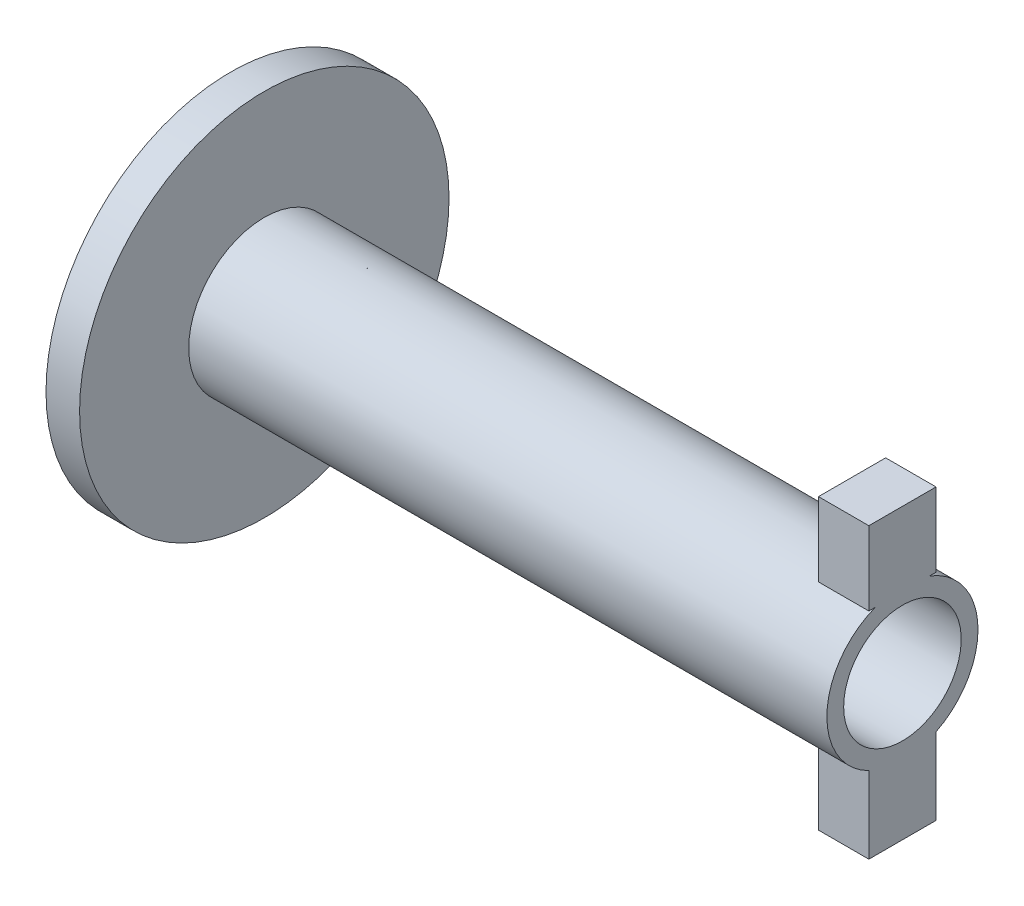
ISO-10303-21;
HEADER;
FILE_DESCRIPTION(('STEP AP214'),'2;1');
FILE_NAME('part.step','',(''),(''),'','','');
FILE_SCHEMA(('AUTOMOTIVE_DESIGN { 1 0 10303 214 1 1 1 1 }'));
ENDSEC;
DATA;
#1=APPLICATION_CONTEXT('core data for automotive mechanical design processes');
#2=APPLICATION_PROTOCOL_DEFINITION('international standard','automotive_design',2000,#1);
#3=PRODUCT_CONTEXT('',#1,'mechanical');
#4=PRODUCT('Part','Part','',(#3));
#5=PRODUCT_RELATED_PRODUCT_CATEGORY('part','',(#4));
#6=PRODUCT_DEFINITION_FORMATION('','',#4);
#7=PRODUCT_DEFINITION_CONTEXT('part definition',#1,'design');
#8=PRODUCT_DEFINITION('design','',#6,#7);
#9=PRODUCT_DEFINITION_SHAPE('','',#8);
#10=(LENGTH_UNIT() NAMED_UNIT(*) SI_UNIT(.MILLI.,.METRE.));
#11=(NAMED_UNIT(*) PLANE_ANGLE_UNIT() SI_UNIT($,.RADIAN.));
#12=(NAMED_UNIT(*) SI_UNIT($,.STERADIAN.) SOLID_ANGLE_UNIT());
#13=UNCERTAINTY_MEASURE_WITH_UNIT(LENGTH_MEASURE(1.E-05),#10,'distance_accuracy_value','');
#14=(GEOMETRIC_REPRESENTATION_CONTEXT(3) GLOBAL_UNCERTAINTY_ASSIGNED_CONTEXT((#13)) GLOBAL_UNIT_ASSIGNED_CONTEXT((#10,
#11,#12)) REPRESENTATION_CONTEXT('',''));
#15=CARTESIAN_POINT('',(0.,0.,0.));
#16=DIRECTION('',(0.,0.,1.));
#17=DIRECTION('',(1.,0.,0.));
#18=AXIS2_PLACEMENT_3D('',#15,#16,#17);
#19=CARTESIAN_POINT('',(10.,0.,0.));
#20=DIRECTION('',(-1.,0.,0.));
#21=DIRECTION('',(0.,0.,1.));
#22=AXIS2_PLACEMENT_3D('',#19,#20,#21);
#23=CYLINDRICAL_SURFACE('',#22,55.);
#24=CARTESIAN_POINT('',(10.,0.,0.));
#25=DIRECTION('',(1.,0.,0.));
#26=DIRECTION('',(0.,0.,-1.));
#27=AXIS2_PLACEMENT_3D('',#24,#25,#26);
#28=CIRCLE('',#27,55.);
#29=CARTESIAN_POINT('',(10.,0.,-55.));
#30=VERTEX_POINT('',#29);
#31=EDGE_CURVE('E198',#30,#30,#28,.T.);
#32=ORIENTED_EDGE('',*,*,#31,.F.);
#33=EDGE_LOOP('',(#32));
#34=FACE_BOUND('',#33,.T.);
#35=CARTESIAN_POINT('',(0.,0.,0.));
#36=DIRECTION('',(1.,0.,0.));
#37=DIRECTION('',(0.,0.,-1.));
#38=AXIS2_PLACEMENT_3D('',#35,#36,#37);
#39=CIRCLE('',#38,55.);
#40=CARTESIAN_POINT('',(0.,0.,-55.));
#41=VERTEX_POINT('',#40);
#42=EDGE_CURVE('E194',#41,#41,#39,.T.);
#43=ORIENTED_EDGE('',*,*,#42,.T.);
#44=EDGE_LOOP('',(#43));
#45=FACE_BOUND('',#44,.T.);
#46=ADVANCED_FACE('F36',(#34,#45),#23,.T.);
#47=CARTESIAN_POINT('',(10.,0.,0.));
#48=DIRECTION('',(1.,0.,0.));
#49=DIRECTION('',(0.,0.,-1.));
#50=AXIS2_PLACEMENT_3D('',#47,#48,#49);
#51=PLANE('',#50);
#52=CARTESIAN_POINT('',(10.,0.,0.));
#53=DIRECTION('',(1.,0.,0.));
#54=DIRECTION('',(0.,0.,-1.));
#55=AXIS2_PLACEMENT_3D('',#52,#53,#54);
#56=CIRCLE('',#55,22.5);
#57=CARTESIAN_POINT('',(10.,0.,-22.5));
#58=VERTEX_POINT('',#57);
#59=EDGE_CURVE('E195',#58,#58,#56,.T.);
#60=ORIENTED_EDGE('',*,*,#59,.F.);
#61=EDGE_LOOP('',(#60));
#62=FACE_BOUND('',#61,.T.);
#63=ORIENTED_EDGE('',*,*,#31,.T.);
#64=EDGE_LOOP('',(#63));
#65=FACE_BOUND('',#64,.T.);
#66=ADVANCED_FACE('F231',(#62,#65),#51,.T.);
#67=CARTESIAN_POINT('',(0.,0.,0.));
#68=DIRECTION('',(1.,0.,0.));
#69=DIRECTION('',(0.,0.,-1.));
#70=AXIS2_PLACEMENT_3D('',#67,#68,#69);
#71=PLANE('',#70);
#72=CARTESIAN_POINT('',(0.,0.,0.));
#73=DIRECTION('',(1.,0.,0.));
#74=DIRECTION('',(0.,0.,-1.));
#75=AXIS2_PLACEMENT_3D('',#72,#73,#74);
#76=CIRCLE('',#75,17.5);
#77=CARTESIAN_POINT('',(0.,0.,-17.5));
#78=VERTEX_POINT('',#77);
#79=EDGE_CURVE('E188',#78,#78,#76,.T.);
#80=ORIENTED_EDGE('',*,*,#79,.T.);
#81=EDGE_LOOP('',(#80));
#82=FACE_BOUND('',#81,.T.);
#83=ORIENTED_EDGE('',*,*,#42,.F.);
#84=EDGE_LOOP('',(#83));
#85=FACE_BOUND('',#84,.T.);
#86=ADVANCED_FACE('F228',(#82,#85),#71,.F.);
#87=CARTESIAN_POINT('',(200.,0.,0.));
#88=DIRECTION('',(-1.,0.,0.));
#89=DIRECTION('',(0.,0.,1.));
#90=AXIS2_PLACEMENT_3D('',#87,#88,#89);
#91=CYLINDRICAL_SURFACE('',#90,22.5);
#92=CARTESIAN_POINT('',(200.,0.,0.));
#93=DIRECTION('',(1.,0.,0.));
#94=DIRECTION('',(0.,0.,-1.));
#95=AXIS2_PLACEMENT_3D('',#92,#93,#94);
#96=CIRCLE('',#95,22.5);
#97=CARTESIAN_POINT('',(200.,-20.1556443707464,-10.));
#98=VERTEX_POINT('',#97);
#99=CARTESIAN_POINT('',(200.,21.,-8.07774721070176));
#100=VERTEX_POINT('',#99);
#101=EDGE_CURVE('E191',#98,#100,#96,.T.);
#102=ORIENTED_EDGE('',*,*,#101,.F.);
#103=DIRECTION('',(-1.,0.,0.));
#104=VECTOR('',#103,1.);
#105=CARTESIAN_POINT('',(200.,-20.1556443707464,-10.));
#106=LINE('',#105,#104);
#107=CARTESIAN_POINT('',(185.,-20.1556443707464,-10.));
#108=VERTEX_POINT('',#107);
#109=EDGE_CURVE('E144',#98,#108,#106,.T.);
#110=ORIENTED_EDGE('',*,*,#109,.T.);
#111=CARTESIAN_POINT('',(185.,0.,0.));
#112=DIRECTION('',(1.,0.,0.));
#113=DIRECTION('',(0.,0.,-1.));
#114=AXIS2_PLACEMENT_3D('',#111,#112,#113);
#115=CIRCLE('',#114,22.5);
#116=CARTESIAN_POINT('',(185.,-20.1556443707464,10.));
#117=VERTEX_POINT('',#116);
#118=EDGE_CURVE('E11',#117,#108,#115,.T.);
#119=ORIENTED_EDGE('',*,*,#118,.F.);
#120=DIRECTION('',(-1.,0.,0.));
#121=VECTOR('',#120,1.);
#122=CARTESIAN_POINT('',(200.,-20.1556443707464,10.));
#123=LINE('',#122,#121);
#124=CARTESIAN_POINT('',(200.,-20.1556443707464,10.));
#125=VERTEX_POINT('',#124);
#126=EDGE_CURVE('E119',#117,#125,#123,.F.);
#127=ORIENTED_EDGE('',*,*,#126,.T.);
#128=CARTESIAN_POINT('',(200.,21.,8.07774721070176));
#129=VERTEX_POINT('',#128);
#130=EDGE_CURVE('E192',#129,#125,#96,.T.);
#131=ORIENTED_EDGE('',*,*,#130,.F.);
#132=DIRECTION('',(-1.,0.,0.));
#133=VECTOR('',#132,1.);
#134=CARTESIAN_POINT('',(200.,21.,8.07774721070176));
#135=LINE('',#134,#133);
#136=CARTESIAN_POINT('',(185.,21.,8.07774721070176));
#137=VERTEX_POINT('',#136);
#138=EDGE_CURVE('E182',#129,#137,#135,.T.);
#139=ORIENTED_EDGE('',*,*,#138,.T.);
#140=CARTESIAN_POINT('',(185.,0.,0.));
#141=DIRECTION('',(1.,0.,0.));
#142=DIRECTION('',(0.,0.,-1.));
#143=AXIS2_PLACEMENT_3D('',#140,#141,#142);
#144=CIRCLE('',#143,22.5);
#145=CARTESIAN_POINT('',(185.,21.,-8.07774721070176));
#146=VERTEX_POINT('',#145);
#147=EDGE_CURVE('E43',#146,#137,#144,.T.);
#148=ORIENTED_EDGE('',*,*,#147,.F.);
#149=DIRECTION('',(-1.,0.,0.));
#150=VECTOR('',#149,1.);
#151=CARTESIAN_POINT('',(200.,21.,-8.07774721070176));
#152=LINE('',#151,#150);
#153=EDGE_CURVE('E174',#146,#100,#152,.F.);
#154=ORIENTED_EDGE('',*,*,#153,.T.);
#155=EDGE_LOOP('',(#102,#110,#119,#127,#131,#139,#148,#154));
#156=FACE_BOUND('',#155,.T.);
#157=ORIENTED_EDGE('',*,*,#59,.T.);
#158=EDGE_LOOP('',(#157));
#159=FACE_BOUND('',#158,.T.);
#160=ADVANCED_FACE('F214',(#156,#159),#91,.T.);
#161=CARTESIAN_POINT('',(200.,0.,0.));
#162=DIRECTION('',(1.,0.,0.));
#163=DIRECTION('',(0.,0.,-1.));
#164=AXIS2_PLACEMENT_3D('',#161,#162,#163);
#165=PLANE('',#164);
#166=ORIENTED_EDGE('',*,*,#130,.T.);
#167=DIRECTION('',(0.,-1.,0.));
#168=VECTOR('',#167,1.);
#169=CARTESIAN_POINT('',(200.,-20.,10.));
#170=LINE('',#169,#168);
#171=CARTESIAN_POINT('',(200.,-43.,9.99999999999999));
#172=VERTEX_POINT('',#171);
#173=EDGE_CURVE('E139',#125,#172,#170,.T.);
#174=ORIENTED_EDGE('',*,*,#173,.T.);
#175=DIRECTION('',(0.,0.,-1.));
#176=VECTOR('',#175,1.);
#177=CARTESIAN_POINT('',(200.,-43.,9.99999999999999));
#178=LINE('',#177,#176);
#179=CARTESIAN_POINT('',(200.,-43.,-10.));
#180=VERTEX_POINT('',#179);
#181=EDGE_CURVE('E129',#172,#180,#178,.T.);
#182=ORIENTED_EDGE('',*,*,#181,.T.);
#183=DIRECTION('',(0.,1.,0.));
#184=VECTOR('',#183,1.);
#185=CARTESIAN_POINT('',(200.,-20.,-10.));
#186=LINE('',#185,#184);
#187=EDGE_CURVE('E50',#180,#98,#186,.T.);
#188=ORIENTED_EDGE('',*,*,#187,.T.);
#189=ORIENTED_EDGE('',*,*,#101,.T.);
#190=DIRECTION('',(0.,0.,-1.));
#191=VECTOR('',#190,1.);
#192=CARTESIAN_POINT('',(200.,21.,10.));
#193=LINE('',#192,#191);
#194=CARTESIAN_POINT('',(200.,21.,-10.));
#195=VERTEX_POINT('',#194);
#196=EDGE_CURVE('E169',#100,#195,#193,.T.);
#197=ORIENTED_EDGE('',*,*,#196,.T.);
#198=DIRECTION('',(0.,1.,0.));
#199=VECTOR('',#198,1.);
#200=CARTESIAN_POINT('',(200.,43.,-10.));
#201=LINE('',#200,#199);
#202=CARTESIAN_POINT('',(200.,43.,-10.));
#203=VERTEX_POINT('',#202);
#204=EDGE_CURVE('E147',#195,#203,#201,.T.);
#205=ORIENTED_EDGE('',*,*,#204,.T.);
#206=DIRECTION('',(0.,0.,1.));
#207=VECTOR('',#206,1.);
#208=CARTESIAN_POINT('',(200.,43.,10.));
#209=LINE('',#208,#207);
#210=CARTESIAN_POINT('',(200.,43.,10.));
#211=VERTEX_POINT('',#210);
#212=EDGE_CURVE('E164',#203,#211,#209,.T.);
#213=ORIENTED_EDGE('',*,*,#212,.T.);
#214=DIRECTION('',(0.,-1.,0.));
#215=VECTOR('',#214,1.);
#216=CARTESIAN_POINT('',(200.,43.,10.));
#217=LINE('',#216,#215);
#218=CARTESIAN_POINT('',(200.,21.,10.));
#219=VERTEX_POINT('',#218);
#220=EDGE_CURVE('E167',#211,#219,#217,.T.);
#221=ORIENTED_EDGE('',*,*,#220,.T.);
#222=EDGE_CURVE('E57',#219,#129,#193,.T.);
#223=ORIENTED_EDGE('',*,*,#222,.T.);
#224=EDGE_LOOP('',(#166,#174,#182,#188,#189,#197,#205,#213,#221,#223));
#225=FACE_BOUND('',#224,.T.);
#226=CARTESIAN_POINT('',(200.,0.,0.));
#227=DIRECTION('',(-1.,0.,0.));
#228=DIRECTION('',(0.,0.,1.));
#229=AXIS2_PLACEMENT_3D('',#226,#227,#228);
#230=CIRCLE('',#229,17.5);
#231=CARTESIAN_POINT('',(200.,0.,17.5));
#232=VERTEX_POINT('',#231);
#233=EDGE_CURVE('E185',#232,#232,#230,.T.);
#234=ORIENTED_EDGE('',*,*,#233,.T.);
#235=EDGE_LOOP('',(#234));
#236=FACE_BOUND('',#235,.T.);
#237=ADVANCED_FACE('F216',(#225,#236),#165,.T.);
#238=CARTESIAN_POINT('',(200.,0.,0.));
#239=DIRECTION('',(-1.,0.,0.));
#240=DIRECTION('',(0.,0.,1.));
#241=AXIS2_PLACEMENT_3D('',#238,#239,#240);
#242=CYLINDRICAL_SURFACE('',#241,17.5);
#243=ORIENTED_EDGE('',*,*,#233,.F.);
#244=EDGE_LOOP('',(#243));
#245=FACE_BOUND('',#244,.T.);
#246=ORIENTED_EDGE('',*,*,#79,.F.);
#247=EDGE_LOOP('',(#246));
#248=FACE_BOUND('',#247,.T.);
#249=ADVANCED_FACE('F219',(#245,#248),#242,.F.);
#250=CARTESIAN_POINT('',(185.,21.,10.));
#251=DIRECTION('',(0.,-1.,0.));
#252=DIRECTION('',(0.,0.,-1.));
#253=AXIS2_PLACEMENT_3D('',#250,#251,#252);
#254=PLANE('',#253);
#255=ORIENTED_EDGE('',*,*,#138,.F.);
#256=ORIENTED_EDGE('',*,*,#222,.F.);
#257=DIRECTION('',(1.,0.,0.));
#258=VECTOR('',#257,1.);
#259=CARTESIAN_POINT('',(185.,21.,10.));
#260=LINE('',#259,#258);
#261=CARTESIAN_POINT('',(185.,21.,10.));
#262=VERTEX_POINT('',#261);
#263=EDGE_CURVE('E175',#262,#219,#260,.T.);
#264=ORIENTED_EDGE('',*,*,#263,.F.);
#265=DIRECTION('',(0.,0.,-1.));
#266=VECTOR('',#265,1.);
#267=CARTESIAN_POINT('',(185.,21.,10.));
#268=LINE('',#267,#266);
#269=EDGE_CURVE('E158',#262,#137,#268,.T.);
#270=ORIENTED_EDGE('',*,*,#269,.T.);
#271=EDGE_LOOP('',(#255,#256,#264,#270));
#272=FACE_BOUND('',#271,.T.);
#273=ADVANCED_FACE('F211',(#272),#254,.T.);
#274=ORIENTED_EDGE('',*,*,#153,.F.);
#275=CARTESIAN_POINT('',(185.,21.,-10.));
#276=VERTEX_POINT('',#275);
#277=EDGE_CURVE('E157',#146,#276,#268,.T.);
#278=ORIENTED_EDGE('',*,*,#277,.T.);
#279=DIRECTION('',(1.,0.,0.));
#280=VECTOR('',#279,1.);
#281=CARTESIAN_POINT('',(185.,21.,-10.));
#282=LINE('',#281,#280);
#283=EDGE_CURVE('E171',#276,#195,#282,.T.);
#284=ORIENTED_EDGE('',*,*,#283,.T.);
#285=ORIENTED_EDGE('',*,*,#196,.F.);
#286=EDGE_LOOP('',(#274,#278,#284,#285));
#287=FACE_BOUND('',#286,.T.);
#288=ADVANCED_FACE('F253',(#287),#254,.T.);
#289=CARTESIAN_POINT('',(185.,43.,-10.));
#290=DIRECTION('',(0.,0.,-1.));
#291=DIRECTION('',(0.,1.,0.));
#292=AXIS2_PLACEMENT_3D('',#289,#290,#291);
#293=PLANE('',#292);
#294=ORIENTED_EDGE('',*,*,#204,.F.);
#295=ORIENTED_EDGE('',*,*,#283,.F.);
#296=DIRECTION('',(0.,1.,0.));
#297=VECTOR('',#296,1.);
#298=CARTESIAN_POINT('',(185.,43.,-10.));
#299=LINE('',#298,#297);
#300=CARTESIAN_POINT('',(185.,43.,-10.));
#301=VERTEX_POINT('',#300);
#302=EDGE_CURVE('E148',#276,#301,#299,.T.);
#303=ORIENTED_EDGE('',*,*,#302,.T.);
#304=DIRECTION('',(1.,0.,0.));
#305=VECTOR('',#304,1.);
#306=CARTESIAN_POINT('',(185.,43.,-10.));
#307=LINE('',#306,#305);
#308=EDGE_CURVE('E161',#301,#203,#307,.T.);
#309=ORIENTED_EDGE('',*,*,#308,.T.);
#310=EDGE_LOOP('',(#294,#295,#303,#309));
#311=FACE_BOUND('',#310,.T.);
#312=ADVANCED_FACE('F249',(#311),#293,.T.);
#313=CARTESIAN_POINT('',(185.,43.,10.));
#314=DIRECTION('',(0.,0.,1.));
#315=DIRECTION('',(0.,-1.,0.));
#316=AXIS2_PLACEMENT_3D('',#313,#314,#315);
#317=PLANE('',#316);
#318=ORIENTED_EDGE('',*,*,#220,.F.);
#319=DIRECTION('',(1.,0.,0.));
#320=VECTOR('',#319,1.);
#321=CARTESIAN_POINT('',(185.,43.,10.));
#322=LINE('',#321,#320);
#323=CARTESIAN_POINT('',(185.,43.,10.));
#324=VERTEX_POINT('',#323);
#325=EDGE_CURVE('E177',#324,#211,#322,.T.);
#326=ORIENTED_EDGE('',*,*,#325,.F.);
#327=DIRECTION('',(0.,-1.,0.));
#328=VECTOR('',#327,1.);
#329=CARTESIAN_POINT('',(185.,43.,10.));
#330=LINE('',#329,#328);
#331=EDGE_CURVE('E154',#324,#262,#330,.T.);
#332=ORIENTED_EDGE('',*,*,#331,.T.);
#333=ORIENTED_EDGE('',*,*,#263,.T.);
#334=EDGE_LOOP('',(#318,#326,#332,#333));
#335=FACE_BOUND('',#334,.T.);
#336=ADVANCED_FACE('F252',(#335),#317,.T.);
#337=CARTESIAN_POINT('',(185.,43.,10.));
#338=DIRECTION('',(0.,1.,0.));
#339=DIRECTION('',(0.,0.,1.));
#340=AXIS2_PLACEMENT_3D('',#337,#338,#339);
#341=PLANE('',#340);
#342=ORIENTED_EDGE('',*,*,#212,.F.);
#343=ORIENTED_EDGE('',*,*,#308,.F.);
#344=DIRECTION('',(0.,0.,1.));
#345=VECTOR('',#344,1.);
#346=CARTESIAN_POINT('',(185.,43.,10.));
#347=LINE('',#346,#345);
#348=EDGE_CURVE('E151',#301,#324,#347,.T.);
#349=ORIENTED_EDGE('',*,*,#348,.T.);
#350=ORIENTED_EDGE('',*,*,#325,.T.);
#351=EDGE_LOOP('',(#342,#343,#349,#350));
#352=FACE_BOUND('',#351,.T.);
#353=ADVANCED_FACE('F255',(#352),#341,.T.);
#354=CARTESIAN_POINT('',(185.,0.,0.));
#355=DIRECTION('',(1.,0.,0.));
#356=DIRECTION('',(0.,0.,-1.));
#357=AXIS2_PLACEMENT_3D('',#354,#355,#356);
#358=PLANE('',#357);
#359=ORIENTED_EDGE('',*,*,#277,.F.);
#360=ORIENTED_EDGE('',*,*,#147,.T.);
#361=ORIENTED_EDGE('',*,*,#269,.F.);
#362=ORIENTED_EDGE('',*,*,#331,.F.);
#363=ORIENTED_EDGE('',*,*,#348,.F.);
#364=ORIENTED_EDGE('',*,*,#302,.F.);
#365=EDGE_LOOP('',(#359,#360,#361,#362,#363,#364));
#366=FACE_BOUND('',#365,.T.);
#367=ADVANCED_FACE('F206',(#366),#358,.F.);
#368=CARTESIAN_POINT('',(185.,-20.,-10.));
#369=DIRECTION('',(0.,0.,-1.));
#370=DIRECTION('',(0.,1.,0.));
#371=AXIS2_PLACEMENT_3D('',#368,#369,#370);
#372=PLANE('',#371);
#373=ORIENTED_EDGE('',*,*,#109,.F.);
#374=ORIENTED_EDGE('',*,*,#187,.F.);
#375=DIRECTION('',(1.,0.,0.));
#376=VECTOR('',#375,1.);
#377=CARTESIAN_POINT('',(185.,-43.,-10.));
#378=LINE('',#377,#376);
#379=CARTESIAN_POINT('',(185.,-43.,-10.));
#380=VERTEX_POINT('',#379);
#381=EDGE_CURVE('E130',#380,#180,#378,.T.);
#382=ORIENTED_EDGE('',*,*,#381,.F.);
#383=DIRECTION('',(0.,1.,0.));
#384=VECTOR('',#383,1.);
#385=CARTESIAN_POINT('',(185.,-20.,-10.));
#386=LINE('',#385,#384);
#387=EDGE_CURVE('E124',#380,#108,#386,.T.);
#388=ORIENTED_EDGE('',*,*,#387,.T.);
#389=EDGE_LOOP('',(#373,#374,#382,#388));
#390=FACE_BOUND('',#389,.T.);
#391=ADVANCED_FACE('F266',(#390),#372,.T.);
#392=CARTESIAN_POINT('',(185.,-20.,10.));
#393=DIRECTION('',(0.,0.,1.));
#394=DIRECTION('',(0.,-1.,0.));
#395=AXIS2_PLACEMENT_3D('',#392,#393,#394);
#396=PLANE('',#395);
#397=ORIENTED_EDGE('',*,*,#126,.F.);
#398=DIRECTION('',(0.,-1.,0.));
#399=VECTOR('',#398,1.);
#400=CARTESIAN_POINT('',(185.,-20.,10.));
#401=LINE('',#400,#399);
#402=CARTESIAN_POINT('',(185.,-43.,9.99999999999999));
#403=VERTEX_POINT('',#402);
#404=EDGE_CURVE('E113',#117,#403,#401,.T.);
#405=ORIENTED_EDGE('',*,*,#404,.T.);
#406=DIRECTION('',(1.,0.,0.));
#407=VECTOR('',#406,1.);
#408=CARTESIAN_POINT('',(185.,-43.,9.99999999999999));
#409=LINE('',#408,#407);
#410=EDGE_CURVE('E116',#403,#172,#409,.T.);
#411=ORIENTED_EDGE('',*,*,#410,.T.);
#412=ORIENTED_EDGE('',*,*,#173,.F.);
#413=EDGE_LOOP('',(#397,#405,#411,#412));
#414=FACE_BOUND('',#413,.T.);
#415=ADVANCED_FACE('F115',(#414),#396,.T.);
#416=CARTESIAN_POINT('',(185.,-43.,9.99999999999999));
#417=DIRECTION('',(0.,-1.,0.));
#418=DIRECTION('',(0.,0.,-1.));
#419=AXIS2_PLACEMENT_3D('',#416,#417,#418);
#420=PLANE('',#419);
#421=ORIENTED_EDGE('',*,*,#181,.F.);
#422=ORIENTED_EDGE('',*,*,#410,.F.);
#423=DIRECTION('',(0.,0.,-1.));
#424=VECTOR('',#423,1.);
#425=CARTESIAN_POINT('',(185.,-43.,9.99999999999999));
#426=LINE('',#425,#424);
#427=EDGE_CURVE('E123',#403,#380,#426,.T.);
#428=ORIENTED_EDGE('',*,*,#427,.T.);
#429=ORIENTED_EDGE('',*,*,#381,.T.);
#430=EDGE_LOOP('',(#421,#422,#428,#429));
#431=FACE_BOUND('',#430,.T.);
#432=ADVANCED_FACE('F128',(#431),#420,.T.);
#433=CARTESIAN_POINT('',(185.,0.,0.));
#434=DIRECTION('',(1.,0.,0.));
#435=DIRECTION('',(0.,0.,-1.));
#436=AXIS2_PLACEMENT_3D('',#433,#434,#435);
#437=PLANE('',#436);
#438=ORIENTED_EDGE('',*,*,#404,.F.);
#439=ORIENTED_EDGE('',*,*,#118,.T.);
#440=ORIENTED_EDGE('',*,*,#387,.F.);
#441=ORIENTED_EDGE('',*,*,#427,.F.);
#442=EDGE_LOOP('',(#438,#439,#440,#441));
#443=FACE_BOUND('',#442,.T.);
#444=ADVANCED_FACE('F133',(#443),#437,.F.);
#445=CLOSED_SHELL('',(#46,#66,#86,#160,#237,#249,#273,#288,#312,#336,#353,#367,#391,#415,#432,#444));
#446=MANIFOLD_SOLID_BREP('B2',#445);
#447=ADVANCED_BREP_SHAPE_REPRESENTATION('',(#18,#446),#14);
#448=SHAPE_DEFINITION_REPRESENTATION(#9,#447);
ENDSEC;
END-ISO-10303-21;
